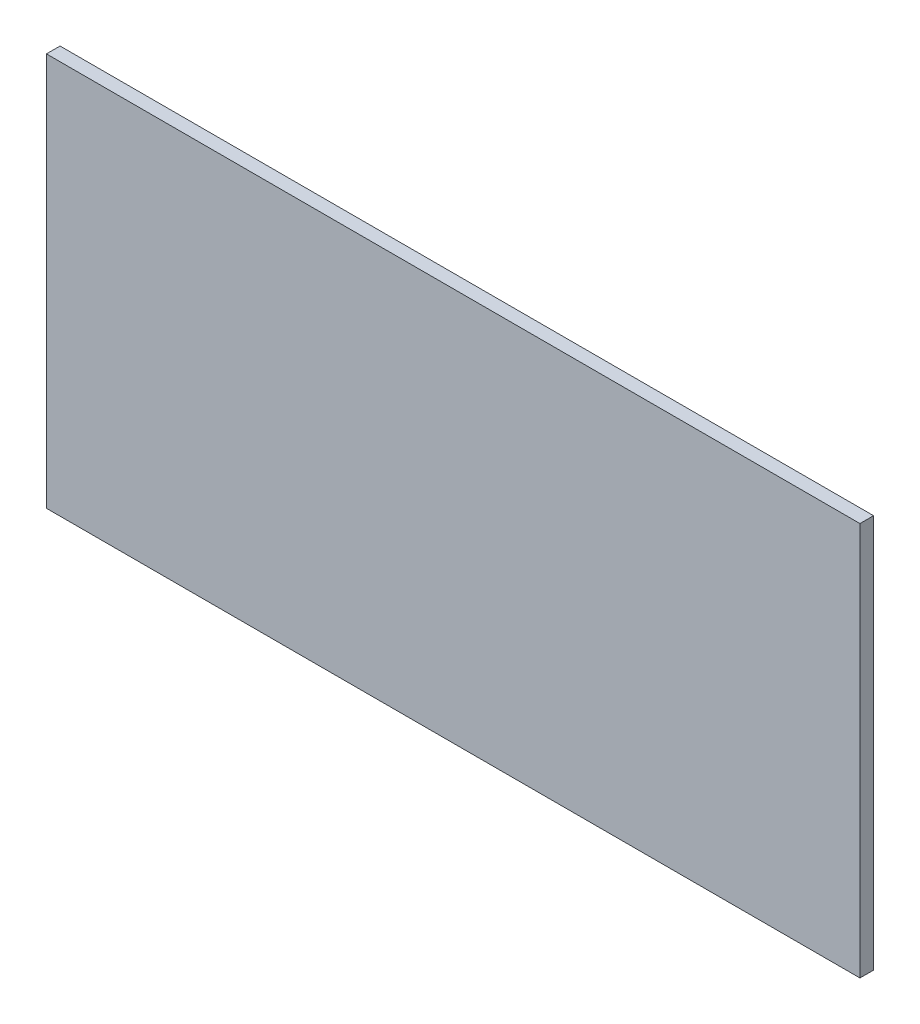
ISO-10303-21;
HEADER;
FILE_DESCRIPTION(('STEP AP214'),'2;1');
FILE_NAME('part.step','',(''),(''),'','','');
FILE_SCHEMA(('AUTOMOTIVE_DESIGN { 1 0 10303 214 1 1 1 1 }'));
ENDSEC;
DATA;
#1=APPLICATION_CONTEXT('core data for automotive mechanical design processes');
#2=APPLICATION_PROTOCOL_DEFINITION('international standard','automotive_design',2000,#1);
#3=PRODUCT_CONTEXT('',#1,'mechanical');
#4=PRODUCT('Part','Part','',(#3));
#5=PRODUCT_RELATED_PRODUCT_CATEGORY('part','',(#4));
#6=PRODUCT_DEFINITION_FORMATION('','',#4);
#7=PRODUCT_DEFINITION_CONTEXT('part definition',#1,'design');
#8=PRODUCT_DEFINITION('design','',#6,#7);
#9=PRODUCT_DEFINITION_SHAPE('','',#8);
#10=(LENGTH_UNIT() NAMED_UNIT(*) SI_UNIT(.MILLI.,.METRE.));
#11=(NAMED_UNIT(*) PLANE_ANGLE_UNIT() SI_UNIT($,.RADIAN.));
#12=(NAMED_UNIT(*) SI_UNIT($,.STERADIAN.) SOLID_ANGLE_UNIT());
#13=UNCERTAINTY_MEASURE_WITH_UNIT(LENGTH_MEASURE(1.E-05),#10,'distance_accuracy_value','');
#14=(GEOMETRIC_REPRESENTATION_CONTEXT(3) GLOBAL_UNCERTAINTY_ASSIGNED_CONTEXT((#13)) GLOBAL_UNIT_ASSIGNED_CONTEXT((#10,
#11,#12)) REPRESENTATION_CONTEXT('',''));
#15=CARTESIAN_POINT('',(0.,0.,0.));
#16=DIRECTION('',(0.,0.,1.));
#17=DIRECTION('',(1.,0.,0.));
#18=AXIS2_PLACEMENT_3D('',#15,#16,#17);
#19=CARTESIAN_POINT('',(53.8960507069722,74.1070697220868,-3.));
#20=DIRECTION('',(1.,0.,0.));
#21=DIRECTION('',(0.,0.,-1.));
#22=AXIS2_PLACEMENT_3D('',#19,#20,#21);
#23=PLANE('',#22);
#24=DIRECTION('',(0.,1.,0.));
#25=VECTOR('',#24,1.);
#26=CARTESIAN_POINT('',(53.8960507069722,74.1070697220868,0.));
#27=LINE('',#26,#25);
#28=CARTESIAN_POINT('',(53.8960507069722,-12.5493255322607,0.));
#29=VERTEX_POINT('',#28);
#30=CARTESIAN_POINT('',(53.8960507069722,74.1070697220868,0.));
#31=VERTEX_POINT('',#30);
#32=EDGE_CURVE('E106',#29,#31,#27,.T.);
#33=ORIENTED_EDGE('',*,*,#32,.F.);
#34=DIRECTION('',(0.,0.,1.));
#35=VECTOR('',#34,1.);
#36=CARTESIAN_POINT('',(53.8960507069722,-12.5493255322607,-3.));
#37=LINE('',#36,#35);
#38=CARTESIAN_POINT('',(53.8960507069722,-12.5493255322607,-3.));
#39=VERTEX_POINT('',#38);
#40=EDGE_CURVE('E11',#39,#29,#37,.T.);
#41=ORIENTED_EDGE('',*,*,#40,.F.);
#42=DIRECTION('',(0.,1.,0.));
#43=VECTOR('',#42,1.);
#44=CARTESIAN_POINT('',(53.8960507069722,74.1070697220868,-3.));
#45=LINE('',#44,#43);
#46=CARTESIAN_POINT('',(53.8960507069722,74.1070697220868,-3.));
#47=VERTEX_POINT('',#46);
#48=EDGE_CURVE('E100',#39,#47,#45,.T.);
#49=ORIENTED_EDGE('',*,*,#48,.T.);
#50=DIRECTION('',(0.,0.,1.));
#51=VECTOR('',#50,1.);
#52=CARTESIAN_POINT('',(53.8960507069722,74.1070697220868,-3.));
#53=LINE('',#52,#51);
#54=EDGE_CURVE('E45',#47,#31,#53,.T.);
#55=ORIENTED_EDGE('',*,*,#54,.T.);
#56=EDGE_LOOP('',(#33,#41,#49,#55));
#57=FACE_BOUND('',#56,.T.);
#58=ADVANCED_FACE('F42',(#57),#23,.T.);
#59=CARTESIAN_POINT('',(-125.229058995612,-12.5493255322607,-3.));
#60=DIRECTION('',(0.,-1.,0.));
#61=DIRECTION('',(0.,0.,-1.));
#62=AXIS2_PLACEMENT_3D('',#59,#60,#61);
#63=PLANE('',#62);
#64=DIRECTION('',(1.,0.,0.));
#65=VECTOR('',#64,1.);
#66=CARTESIAN_POINT('',(-125.229058995612,-12.5493255322607,0.));
#67=LINE('',#66,#65);
#68=CARTESIAN_POINT('',(-125.229058995612,-12.5493255322607,0.));
#69=VERTEX_POINT('',#68);
#70=EDGE_CURVE('E102',#69,#29,#67,.T.);
#71=ORIENTED_EDGE('',*,*,#70,.F.);
#72=DIRECTION('',(0.,0.,1.));
#73=VECTOR('',#72,1.);
#74=CARTESIAN_POINT('',(-125.229058995612,-12.5493255322607,-3.));
#75=LINE('',#74,#73);
#76=CARTESIAN_POINT('',(-125.229058995612,-12.5493255322607,-3.));
#77=VERTEX_POINT('',#76);
#78=EDGE_CURVE('E51',#77,#69,#75,.T.);
#79=ORIENTED_EDGE('',*,*,#78,.F.);
#80=DIRECTION('',(1.,0.,0.));
#81=VECTOR('',#80,1.);
#82=CARTESIAN_POINT('',(-125.229058995612,-12.5493255322607,-3.));
#83=LINE('',#82,#81);
#84=EDGE_CURVE('E97',#77,#39,#83,.T.);
#85=ORIENTED_EDGE('',*,*,#84,.T.);
#86=ORIENTED_EDGE('',*,*,#40,.T.);
#87=EDGE_LOOP('',(#71,#79,#85,#86));
#88=FACE_BOUND('',#87,.T.);
#89=ADVANCED_FACE('F116',(#88),#63,.T.);
#90=CARTESIAN_POINT('',(-125.229058995612,74.1070697220868,-3.));
#91=DIRECTION('',(-1.,0.,0.));
#92=DIRECTION('',(0.,0.,1.));
#93=AXIS2_PLACEMENT_3D('',#90,#91,#92);
#94=PLANE('',#93);
#95=DIRECTION('',(0.,-1.,0.));
#96=VECTOR('',#95,1.);
#97=CARTESIAN_POINT('',(-125.229058995612,74.1070697220868,0.));
#98=LINE('',#97,#96);
#99=CARTESIAN_POINT('',(-125.229058995612,74.1070697220868,0.));
#100=VERTEX_POINT('',#99);
#101=EDGE_CURVE('E92',#100,#69,#98,.T.);
#102=ORIENTED_EDGE('',*,*,#101,.F.);
#103=DIRECTION('',(0.,0.,1.));
#104=VECTOR('',#103,1.);
#105=CARTESIAN_POINT('',(-125.229058995612,74.1070697220868,-3.));
#106=LINE('',#105,#104);
#107=CARTESIAN_POINT('',(-125.229058995612,74.1070697220868,-3.));
#108=VERTEX_POINT('',#107);
#109=EDGE_CURVE('E87',#108,#100,#106,.T.);
#110=ORIENTED_EDGE('',*,*,#109,.F.);
#111=DIRECTION('',(0.,-1.,0.));
#112=VECTOR('',#111,1.);
#113=CARTESIAN_POINT('',(-125.229058995612,74.1070697220868,-3.));
#114=LINE('',#113,#112);
#115=EDGE_CURVE('E90',#108,#77,#114,.T.);
#116=ORIENTED_EDGE('',*,*,#115,.T.);
#117=ORIENTED_EDGE('',*,*,#78,.T.);
#118=EDGE_LOOP('',(#102,#110,#116,#117));
#119=FACE_BOUND('',#118,.T.);
#120=ADVANCED_FACE('F89',(#119),#94,.T.);
#121=CARTESIAN_POINT('',(-125.229058995612,74.1070697220868,-3.));
#122=DIRECTION('',(0.,1.,0.));
#123=DIRECTION('',(0.,0.,1.));
#124=AXIS2_PLACEMENT_3D('',#121,#122,#123);
#125=PLANE('',#124);
#126=DIRECTION('',(-1.,0.,0.));
#127=VECTOR('',#126,1.);
#128=CARTESIAN_POINT('',(-125.229058995612,74.1070697220868,0.));
#129=LINE('',#128,#127);
#130=EDGE_CURVE('E109',#31,#100,#129,.T.);
#131=ORIENTED_EDGE('',*,*,#130,.F.);
#132=ORIENTED_EDGE('',*,*,#54,.F.);
#133=DIRECTION('',(-1.,0.,0.));
#134=VECTOR('',#133,1.);
#135=CARTESIAN_POINT('',(-125.229058995612,74.1070697220868,-3.));
#136=LINE('',#135,#134);
#137=EDGE_CURVE('E96',#47,#108,#136,.T.);
#138=ORIENTED_EDGE('',*,*,#137,.T.);
#139=ORIENTED_EDGE('',*,*,#109,.T.);
#140=EDGE_LOOP('',(#131,#132,#138,#139));
#141=FACE_BOUND('',#140,.T.);
#142=ADVANCED_FACE('F99',(#141),#125,.T.);
#143=CARTESIAN_POINT('',(0.,0.,-3.));
#144=DIRECTION('',(0.,0.,1.));
#145=DIRECTION('',(1.,0.,0.));
#146=AXIS2_PLACEMENT_3D('',#143,#144,#145);
#147=PLANE('',#146);
#148=ORIENTED_EDGE('',*,*,#48,.F.);
#149=ORIENTED_EDGE('',*,*,#84,.F.);
#150=ORIENTED_EDGE('',*,*,#115,.F.);
#151=ORIENTED_EDGE('',*,*,#137,.F.);
#152=EDGE_LOOP('',(#148,#149,#150,#151));
#153=FACE_BOUND('',#152,.T.);
#154=ADVANCED_FACE('F95',(#153),#147,.F.);
#155=CARTESIAN_POINT('',(0.,0.,0.));
#156=DIRECTION('',(0.,0.,1.));
#157=DIRECTION('',(1.,0.,0.));
#158=AXIS2_PLACEMENT_3D('',#155,#156,#157);
#159=PLANE('',#158);
#160=ORIENTED_EDGE('',*,*,#32,.T.);
#161=ORIENTED_EDGE('',*,*,#130,.T.);
#162=ORIENTED_EDGE('',*,*,#101,.T.);
#163=ORIENTED_EDGE('',*,*,#70,.T.);
#164=EDGE_LOOP('',(#160,#161,#162,#163));
#165=FACE_BOUND('',#164,.T.);
#166=ADVANCED_FACE('F115',(#165),#159,.T.);
#167=CLOSED_SHELL('',(#58,#89,#120,#142,#154,#166));
#168=MANIFOLD_SOLID_BREP('B2',#167);
#169=ADVANCED_BREP_SHAPE_REPRESENTATION('',(#18,#168),#14);
#170=SHAPE_DEFINITION_REPRESENTATION(#9,#169);
ENDSEC;
END-ISO-10303-21;
